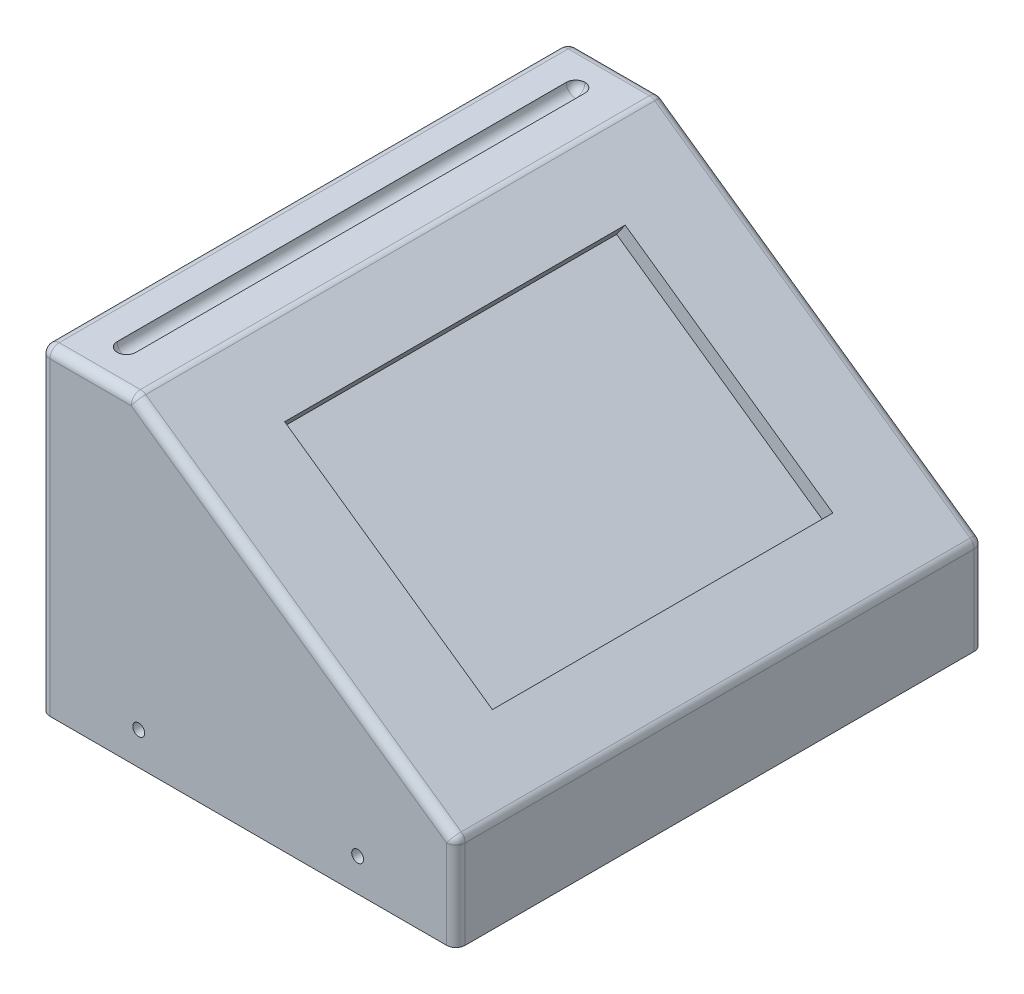
ISO-10303-21;
HEADER;
FILE_DESCRIPTION(('STEP AP214'),'2;1');
FILE_NAME('part.step','',(''),(''),'','','');
FILE_SCHEMA(('AUTOMOTIVE_DESIGN { 1 0 10303 214 1 1 1 1 }'));
ENDSEC;
DATA;
#1=APPLICATION_CONTEXT('core data for automotive mechanical design processes');
#2=APPLICATION_PROTOCOL_DEFINITION('international standard','automotive_design',2000,#1);
#3=PRODUCT_CONTEXT('',#1,'mechanical');
#4=PRODUCT('Part','Part','',(#3));
#5=PRODUCT_RELATED_PRODUCT_CATEGORY('part','',(#4));
#6=PRODUCT_DEFINITION_FORMATION('','',#4);
#7=PRODUCT_DEFINITION_CONTEXT('part definition',#1,'design');
#8=PRODUCT_DEFINITION('design','',#6,#7);
#9=PRODUCT_DEFINITION_SHAPE('','',#8);
#10=(LENGTH_UNIT() NAMED_UNIT(*) SI_UNIT(.MILLI.,.METRE.));
#11=(NAMED_UNIT(*) PLANE_ANGLE_UNIT() SI_UNIT($,.RADIAN.));
#12=(NAMED_UNIT(*) SI_UNIT($,.STERADIAN.) SOLID_ANGLE_UNIT());
#13=UNCERTAINTY_MEASURE_WITH_UNIT(LENGTH_MEASURE(1.E-05),#10,'distance_accuracy_value','');
#14=(GEOMETRIC_REPRESENTATION_CONTEXT(3) GLOBAL_UNCERTAINTY_ASSIGNED_CONTEXT((#13)) GLOBAL_UNIT_ASSIGNED_CONTEXT((#10,
#11,#12)) REPRESENTATION_CONTEXT('',''));
#15=CARTESIAN_POINT('',(0.,0.,0.));
#16=DIRECTION('',(0.,0.,1.));
#17=DIRECTION('',(1.,0.,0.));
#18=AXIS2_PLACEMENT_3D('',#15,#16,#17);
#19=CARTESIAN_POINT('',(0.,120.451051633721,282.));
#20=DIRECTION('',(0.,-1.,0.));
#21=DIRECTION('',(1.,0.,0.));
#22=AXIS2_PLACEMENT_3D('',#19,#20,#21);
#23=PLANE('',#22);
#24=DIRECTION('',(0.,0.,-1.));
#25=VECTOR('',#24,1.);
#26=CARTESIAN_POINT('',(-173.598423245083,120.451051633721,282.));
#27=LINE('',#26,#25);
#28=CARTESIAN_POINT('',(-173.598423245083,120.451051633721,277.));
#29=VERTEX_POINT('',#28);
#30=CARTESIAN_POINT('',(-173.598423245083,120.451051633721,5.));
#31=VERTEX_POINT('',#30);
#32=EDGE_CURVE('E287',#29,#31,#27,.T.);
#33=ORIENTED_EDGE('',*,*,#32,.T.);
#34=DIRECTION('',(-1.,0.,0.));
#35=VECTOR('',#34,1.);
#36=CARTESIAN_POINT('',(0.,120.451051633721,5.));
#37=LINE('',#36,#35);
#38=CARTESIAN_POINT('',(-217.021929300688,120.451051633721,5.));
#39=VERTEX_POINT('',#38);
#40=EDGE_CURVE('E290',#31,#39,#37,.T.);
#41=ORIENTED_EDGE('',*,*,#40,.T.);
#42=DIRECTION('',(0.,0.,-1.));
#43=VECTOR('',#42,1.);
#44=CARTESIAN_POINT('',(-217.021929300688,120.451051633721,282.));
#45=LINE('',#44,#43);
#46=CARTESIAN_POINT('',(-217.021929300688,120.451051633721,277.));
#47=VERTEX_POINT('',#46);
#48=EDGE_CURVE('E285',#39,#47,#45,.F.);
#49=ORIENTED_EDGE('',*,*,#48,.T.);
#50=DIRECTION('',(-1.,0.,0.));
#51=VECTOR('',#50,1.);
#52=CARTESIAN_POINT('',(-172.021929300688,120.451051633721,277.));
#53=LINE('',#52,#51);
#54=EDGE_CURVE('E283',#47,#29,#53,.F.);
#55=ORIENTED_EDGE('',*,*,#54,.T.);
#56=EDGE_LOOP('',(#33,#41,#49,#55));
#57=FACE_BOUND('',#56,.T.);
#58=CARTESIAN_POINT('',(-197.021929300688,120.451051633721,261.));
#59=DIRECTION('',(0.,-1.,0.));
#60=DIRECTION('',(1.,0.,0.));
#61=AXIS2_PLACEMENT_3D('',#58,#59,#60);
#62=CIRCLE('',#61,5.);
#63=CARTESIAN_POINT('',(-192.021929300688,120.451051633721,261.));
#64=VERTEX_POINT('',#63);
#65=CARTESIAN_POINT('',(-197.021929300688,120.451051633721,266.));
#66=VERTEX_POINT('',#65);
#67=EDGE_CURVE('E237',#64,#66,#62,.T.);
#68=ORIENTED_EDGE('',*,*,#67,.T.);
#69=CARTESIAN_POINT('',(-197.021929300688,120.451051633721,261.));
#70=DIRECTION('',(0.,-1.,0.));
#71=DIRECTION('',(1.,0.,0.));
#72=AXIS2_PLACEMENT_3D('',#69,#70,#71);
#73=CIRCLE('',#72,5.);
#74=CARTESIAN_POINT('',(-202.021929300688,120.451051633721,261.));
#75=VERTEX_POINT('',#74);
#76=EDGE_CURVE('E240',#66,#75,#73,.T.);
#77=ORIENTED_EDGE('',*,*,#76,.T.);
#78=DIRECTION('',(0.,0.,-1.));
#79=VECTOR('',#78,1.);
#80=CARTESIAN_POINT('',(-202.021929300688,120.451051633721,0.));
#81=LINE('',#80,#79);
#82=CARTESIAN_POINT('',(-202.021929300688,120.451051633721,21.));
#83=VERTEX_POINT('',#82);
#84=EDGE_CURVE('E267',#75,#83,#81,.T.);
#85=ORIENTED_EDGE('',*,*,#84,.T.);
#86=CARTESIAN_POINT('',(-197.021929300688,120.451051633721,21.));
#87=DIRECTION('',(0.,-1.,0.));
#88=DIRECTION('',(1.,0.,0.));
#89=AXIS2_PLACEMENT_3D('',#86,#87,#88);
#90=CIRCLE('',#89,5.);
#91=CARTESIAN_POINT('',(-197.021929300688,120.451051633721,16.));
#92=VERTEX_POINT('',#91);
#93=EDGE_CURVE('E244',#83,#92,#90,.T.);
#94=ORIENTED_EDGE('',*,*,#93,.T.);
#95=CARTESIAN_POINT('',(-197.021929300688,120.451051633721,21.));
#96=DIRECTION('',(0.,-1.,0.));
#97=DIRECTION('',(1.,0.,0.));
#98=AXIS2_PLACEMENT_3D('',#95,#96,#97);
#99=CIRCLE('',#98,5.);
#100=CARTESIAN_POINT('',(-192.021929300688,120.451051633721,21.));
#101=VERTEX_POINT('',#100);
#102=EDGE_CURVE('E242',#92,#101,#99,.T.);
#103=ORIENTED_EDGE('',*,*,#102,.T.);
#104=DIRECTION('',(0.,0.,-1.));
#105=VECTOR('',#104,1.);
#106=CARTESIAN_POINT('',(-192.021929300688,120.451051633721,0.));
#107=LINE('',#106,#105);
#108=EDGE_CURVE('E210',#64,#101,#107,.T.);
#109=ORIENTED_EDGE('',*,*,#108,.F.);
#110=EDGE_LOOP('',(#68,#77,#85,#94,#103,#109));
#111=FACE_BOUND('',#110,.T.);
#112=ADVANCED_FACE('F39',(#57,#111),#23,.F.);
#113=CARTESIAN_POINT('',(-222.021929300688,0.,282.));
#114=DIRECTION('',(1.,0.,0.));
#115=DIRECTION('',(0.,0.,-1.));
#116=AXIS2_PLACEMENT_3D('',#113,#114,#115);
#117=PLANE('',#116);
#118=DIRECTION('',(0.,0.,-1.));
#119=VECTOR('',#118,1.);
#120=CARTESIAN_POINT('',(-222.021929300688,115.451051633721,282.));
#121=LINE('',#120,#119);
#122=CARTESIAN_POINT('',(-222.021929300688,115.451051633721,277.));
#123=VERTEX_POINT('',#122);
#124=CARTESIAN_POINT('',(-222.021929300688,115.451051633721,5.));
#125=VERTEX_POINT('',#124);
#126=EDGE_CURVE('E294',#123,#125,#121,.T.);
#127=ORIENTED_EDGE('',*,*,#126,.T.);
#128=DIRECTION('',(0.,-1.,0.));
#129=VECTOR('',#128,1.);
#130=CARTESIAN_POINT('',(-222.021929300688,0.,5.));
#131=LINE('',#130,#129);
#132=CARTESIAN_POINT('',(-222.021929300688,-50.,5.));
#133=VERTEX_POINT('',#132);
#134=EDGE_CURVE('E296',#125,#133,#131,.T.);
#135=ORIENTED_EDGE('',*,*,#134,.T.);
#136=DIRECTION('',(0.,0.,-1.));
#137=VECTOR('',#136,1.);
#138=CARTESIAN_POINT('',(-222.021929300688,-50.,282.));
#139=LINE('',#138,#137);
#140=CARTESIAN_POINT('',(-222.021929300688,-50.,277.));
#141=VERTEX_POINT('',#140);
#142=EDGE_CURVE('E234',#141,#133,#139,.T.);
#143=ORIENTED_EDGE('',*,*,#142,.F.);
#144=DIRECTION('',(0.,-1.,0.));
#145=VECTOR('',#144,1.);
#146=CARTESIAN_POINT('',(-222.021929300688,120.451051633721,277.));
#147=LINE('',#146,#145);
#148=EDGE_CURVE('E292',#141,#123,#147,.F.);
#149=ORIENTED_EDGE('',*,*,#148,.T.);
#150=EDGE_LOOP('',(#127,#135,#143,#149));
#151=FACE_BOUND('',#150,.T.);
#152=ADVANCED_FACE('F424',(#151),#117,.F.);
#153=CARTESIAN_POINT('',(0.,-50.,282.));
#154=DIRECTION('',(0.,-1.,0.));
#155=DIRECTION('',(1.,0.,0.));
#156=AXIS2_PLACEMENT_3D('',#153,#154,#155);
#157=PLANE('',#156);
#158=ORIENTED_EDGE('',*,*,#142,.T.);
#159=CARTESIAN_POINT('',(-217.021929300688,-50.,5.));
#160=DIRECTION('',(0.,-1.,0.));
#161=DIRECTION('',(1.,0.,0.));
#162=AXIS2_PLACEMENT_3D('',#159,#160,#161);
#163=CIRCLE('',#162,5.);
#164=CARTESIAN_POINT('',(-217.021929300688,-50.,0.));
#165=VERTEX_POINT('',#164);
#166=EDGE_CURVE('E304',#133,#165,#163,.T.);
#167=ORIENTED_EDGE('',*,*,#166,.T.);
#168=DIRECTION('',(-1.,0.,0.));
#169=VECTOR('',#168,1.);
#170=CARTESIAN_POINT('',(0.,-50.,0.));
#171=LINE('',#170,#169);
#172=CARTESIAN_POINT('',(-5.,-50.,0.));
#173=VERTEX_POINT('',#172);
#174=EDGE_CURVE('E222',#173,#165,#171,.T.);
#175=ORIENTED_EDGE('',*,*,#174,.F.);
#176=CARTESIAN_POINT('',(-5.,-50.,5.));
#177=DIRECTION('',(0.,-1.,0.));
#178=DIRECTION('',(1.,0.,0.));
#179=AXIS2_PLACEMENT_3D('',#176,#177,#178);
#180=CIRCLE('',#179,5.);
#181=CARTESIAN_POINT('',(0.,-50.,5.));
#182=VERTEX_POINT('',#181);
#183=EDGE_CURVE('E302',#173,#182,#180,.T.);
#184=ORIENTED_EDGE('',*,*,#183,.T.);
#185=DIRECTION('',(0.,0.,-1.));
#186=VECTOR('',#185,1.);
#187=CARTESIAN_POINT('',(0.,-50.,282.));
#188=LINE('',#187,#186);
#189=CARTESIAN_POINT('',(0.,-50.,277.));
#190=VERTEX_POINT('',#189);
#191=EDGE_CURVE('E229',#190,#182,#188,.T.);
#192=ORIENTED_EDGE('',*,*,#191,.F.);
#193=CARTESIAN_POINT('',(-5.,-50.,277.));
#194=DIRECTION('',(0.,-1.,0.));
#195=DIRECTION('',(1.,0.,0.));
#196=AXIS2_PLACEMENT_3D('',#193,#194,#195);
#197=CIRCLE('',#196,5.);
#198=CARTESIAN_POINT('',(-5.,-50.,282.));
#199=VERTEX_POINT('',#198);
#200=EDGE_CURVE('E300',#190,#199,#197,.T.);
#201=ORIENTED_EDGE('',*,*,#200,.T.);
#202=DIRECTION('',(-1.,0.,0.));
#203=VECTOR('',#202,1.);
#204=CARTESIAN_POINT('',(0.,-50.,282.));
#205=LINE('',#204,#203);
#206=CARTESIAN_POINT('',(-217.021929300688,-50.,282.));
#207=VERTEX_POINT('',#206);
#208=EDGE_CURVE('E226',#199,#207,#205,.T.);
#209=ORIENTED_EDGE('',*,*,#208,.T.);
#210=CARTESIAN_POINT('',(-217.021929300688,-50.,277.));
#211=DIRECTION('',(0.,-1.,0.));
#212=DIRECTION('',(1.,0.,0.));
#213=AXIS2_PLACEMENT_3D('',#210,#211,#212);
#214=CIRCLE('',#213,5.);
#215=EDGE_CURVE('E298',#207,#141,#214,.T.);
#216=ORIENTED_EDGE('',*,*,#215,.T.);
#217=EDGE_LOOP('',(#158,#167,#175,#184,#192,#201,#209,#216));
#218=FACE_BOUND('',#217,.T.);
#219=ADVANCED_FACE('F430',(#218),#157,.T.);
#220=CARTESIAN_POINT('',(0.,0.,282.));
#221=DIRECTION('',(1.,0.,0.));
#222=DIRECTION('',(0.,0.,-1.));
#223=AXIS2_PLACEMENT_3D('',#220,#221,#222);
#224=PLANE('',#223);
#225=ORIENTED_EDGE('',*,*,#191,.T.);
#226=DIRECTION('',(0.,-1.,0.));
#227=VECTOR('',#226,1.);
#228=CARTESIAN_POINT('',(0.,0.,5.));
#229=LINE('',#228,#227);
#230=CARTESIAN_POINT('',(0.,-2.60283525275872,5.));
#231=VERTEX_POINT('',#230);
#232=EDGE_CURVE('E281',#182,#231,#229,.F.);
#233=ORIENTED_EDGE('',*,*,#232,.T.);
#234=DIRECTION('',(0.,0.,-1.));
#235=VECTOR('',#234,1.);
#236=CARTESIAN_POINT('',(0.,-2.60283525275872,282.));
#237=LINE('',#236,#235);
#238=CARTESIAN_POINT('',(0.,-2.60283525275872,277.));
#239=VERTEX_POINT('',#238);
#240=EDGE_CURVE('E278',#231,#239,#237,.F.);
#241=ORIENTED_EDGE('',*,*,#240,.T.);
#242=DIRECTION('',(0.,-1.,0.));
#243=VECTOR('',#242,1.);
#244=CARTESIAN_POINT('',(0.,0.,277.));
#245=LINE('',#244,#243);
#246=EDGE_CURVE('E276',#239,#190,#245,.T.);
#247=ORIENTED_EDGE('',*,*,#246,.T.);
#248=EDGE_LOOP('',(#225,#233,#241,#247));
#249=FACE_BOUND('',#248,.T.);
#250=ADVANCED_FACE('F791',(#249),#224,.T.);
#251=CARTESIAN_POINT('',(0.,0.,282.));
#252=DIRECTION('',(-0.57357643635105,-0.819152044288989,0.));
#253=DIRECTION('',(0.819152044288989,-0.57357643635105,0.));
#254=AXIS2_PLACEMENT_3D('',#251,#252,#253);
#255=PLANE('',#254);
#256=DIRECTION('',(0.,0.,-1.));
#257=VECTOR('',#256,1.);
#258=CARTESIAN_POINT('',(-2.13211781824475,1.49292496868623,0.));
#259=LINE('',#258,#257);
#260=CARTESIAN_POINT('',(-2.13211781824475,1.49292496868623,277.));
#261=VERTEX_POINT('',#260);
#262=CARTESIAN_POINT('',(-2.13211781824475,1.49292496868623,5.));
#263=VERTEX_POINT('',#262);
#264=EDGE_CURVE('E271',#261,#263,#259,.T.);
#265=ORIENTED_EDGE('',*,*,#264,.T.);
#266=DIRECTION('',(-0.819152044288989,0.57357643635105,0.));
#267=VECTOR('',#266,1.);
#268=CARTESIAN_POINT('',(0.,0.,5.));
#269=LINE('',#268,#267);
#270=CARTESIAN_POINT('',(-170.730541063327,119.546811855165,5.));
#271=VERTEX_POINT('',#270);
#272=EDGE_CURVE('E274',#263,#271,#269,.T.);
#273=ORIENTED_EDGE('',*,*,#272,.T.);
#274=DIRECTION('',(0.,0.,-1.));
#275=VECTOR('',#274,1.);
#276=CARTESIAN_POINT('',(-170.730541063327,119.546811855165,282.));
#277=LINE('',#276,#275);
#278=CARTESIAN_POINT('',(-170.730541063327,119.546811855165,277.));
#279=VERTEX_POINT('',#278);
#280=EDGE_CURVE('E269',#271,#279,#277,.F.);
#281=ORIENTED_EDGE('',*,*,#280,.T.);
#282=DIRECTION('',(-0.819152044288989,0.57357643635105,0.));
#283=VECTOR('',#282,1.);
#284=CARTESIAN_POINT('',(0.,0.,277.));
#285=LINE('',#284,#283);
#286=EDGE_CURVE('E246',#279,#261,#285,.F.);
#287=ORIENTED_EDGE('',*,*,#286,.T.);
#288=EDGE_LOOP('',(#265,#273,#281,#287));
#289=FACE_BOUND('',#288,.T.);
#290=DIRECTION('',(0.819152044288989,-0.57357643635105,0.));
#291=VECTOR('',#290,1.);
#292=CARTESIAN_POINT('',(0.,0.,232.));
#293=LINE('',#292,#291);
#294=CARTESIAN_POINT('',(-141.521587226098,99.0944821951176,232.));
#295=VERTEX_POINT('',#294);
#296=CARTESIAN_POINT('',(-30.5003420745901,21.356569438603,232.));
#297=VERTEX_POINT('',#296);
#298=EDGE_CURVE('E216',#295,#297,#293,.T.);
#299=ORIENTED_EDGE('',*,*,#298,.F.);
#300=DIRECTION('',(0.,0.,1.));
#301=VECTOR('',#300,1.);
#302=CARTESIAN_POINT('',(-141.521587226098,99.0944821951176,0.));
#303=LINE('',#302,#301);
#304=CARTESIAN_POINT('',(-141.521587226098,99.0944821951176,50.));
#305=VERTEX_POINT('',#304);
#306=EDGE_CURVE('E187',#305,#295,#303,.T.);
#307=ORIENTED_EDGE('',*,*,#306,.F.);
#308=DIRECTION('',(0.819152044288989,-0.57357643635105,0.));
#309=VECTOR('',#308,1.);
#310=CARTESIAN_POINT('',(0.,0.,50.));
#311=LINE('',#310,#309);
#312=CARTESIAN_POINT('',(-30.50034207459,21.3565694386029,50.));
#313=VERTEX_POINT('',#312);
#314=EDGE_CURVE('E204',#305,#313,#311,.T.);
#315=ORIENTED_EDGE('',*,*,#314,.T.);
#316=DIRECTION('',(0.,0.,1.));
#317=VECTOR('',#316,1.);
#318=CARTESIAN_POINT('',(-30.50034207459,21.3565694386029,0.));
#319=LINE('',#318,#317);
#320=EDGE_CURVE('E207',#313,#297,#319,.T.);
#321=ORIENTED_EDGE('',*,*,#320,.T.);
#322=EDGE_LOOP('',(#299,#307,#315,#321));
#323=FACE_BOUND('',#322,.T.);
#324=ADVANCED_FACE('F784',(#289,#323),#255,.F.);
#325=CARTESIAN_POINT('',(0.,0.,282.));
#326=DIRECTION('',(0.,0.,1.));
#327=DIRECTION('',(1.,0.,0.));
#328=AXIS2_PLACEMENT_3D('',#325,#326,#327);
#329=PLANE('',#328);
#330=ORIENTED_EDGE('',*,*,#208,.F.);
#331=DIRECTION('',(0.,-1.,0.));
#332=VECTOR('',#331,1.);
#333=CARTESIAN_POINT('',(-5.,0.,282.));
#334=LINE('',#333,#332);
#335=CARTESIAN_POINT('',(-5.,-2.60283525275872,282.));
#336=VERTEX_POINT('',#335);
#337=EDGE_CURVE('E11',#199,#336,#334,.F.);
#338=ORIENTED_EDGE('',*,*,#337,.T.);
#339=DIRECTION('',(-0.819152044288989,0.57357643635105,0.));
#340=VECTOR('',#339,1.);
#341=CARTESIAN_POINT('',(-174.889811482443,116.355291412276,282.));
#342=LINE('',#341,#340);
#343=CARTESIAN_POINT('',(-173.598423245083,115.451051633721,282.));
#344=VERTEX_POINT('',#343);
#345=EDGE_CURVE('E60',#336,#344,#342,.T.);
#346=ORIENTED_EDGE('',*,*,#345,.T.);
#347=DIRECTION('',(-1.,0.,0.));
#348=VECTOR('',#347,1.);
#349=CARTESIAN_POINT('',(-222.021929300688,115.451051633721,282.));
#350=LINE('',#349,#348);
#351=CARTESIAN_POINT('',(-217.021929300688,115.451051633721,282.));
#352=VERTEX_POINT('',#351);
#353=EDGE_CURVE('E56',#344,#352,#350,.T.);
#354=ORIENTED_EDGE('',*,*,#353,.T.);
#355=DIRECTION('',(0.,-1.,0.));
#356=VECTOR('',#355,1.);
#357=CARTESIAN_POINT('',(-217.021929300688,-50.,282.));
#358=LINE('',#357,#356);
#359=EDGE_CURVE('E48',#352,#207,#358,.T.);
#360=ORIENTED_EDGE('',*,*,#359,.T.);
#361=EDGE_LOOP('',(#330,#338,#346,#354,#360));
#362=FACE_BOUND('',#361,.T.);
#363=CARTESIAN_POINT('',(-52.5,-32.5,282.));
#364=DIRECTION('',(0.,0.,1.));
#365=DIRECTION('',(1.,0.,0.));
#366=AXIS2_PLACEMENT_3D('',#363,#364,#365);
#367=CIRCLE('',#366,3.175);
#368=CARTESIAN_POINT('',(-49.325,-32.5,282.));
#369=VERTEX_POINT('',#368);
#370=EDGE_CURVE('E381',#369,#369,#367,.T.);
#371=ORIENTED_EDGE('',*,*,#370,.F.);
#372=EDGE_LOOP('',(#371));
#373=FACE_BOUND('',#372,.T.);
#374=CARTESIAN_POINT('',(-169.521929300688,-32.5,282.));
#375=DIRECTION('',(0.,0.,1.));
#376=DIRECTION('',(1.,0.,0.));
#377=AXIS2_PLACEMENT_3D('',#374,#375,#376);
#378=CIRCLE('',#377,3.175);
#379=CARTESIAN_POINT('',(-166.346929300688,-32.5,282.));
#380=VERTEX_POINT('',#379);
#381=EDGE_CURVE('E384',#380,#380,#378,.T.);
#382=ORIENTED_EDGE('',*,*,#381,.F.);
#383=EDGE_LOOP('',(#382));
#384=FACE_BOUND('',#383,.T.);
#385=ADVANCED_FACE('F777',(#362,#373,#384),#329,.T.);
#386=CARTESIAN_POINT('',(0.,0.,0.));
#387=DIRECTION('',(0.,0.,1.));
#388=DIRECTION('',(1.,0.,0.));
#389=AXIS2_PLACEMENT_3D('',#386,#387,#388);
#390=PLANE('',#389);
#391=CARTESIAN_POINT('',(-169.521929300688,-32.5,0.));
#392=DIRECTION('',(0.,0.,-1.));
#393=DIRECTION('',(-1.,0.,0.));
#394=AXIS2_PLACEMENT_3D('',#391,#392,#393);
#395=CIRCLE('',#394,3.175);
#396=CARTESIAN_POINT('',(-172.696929300688,-32.5,0.));
#397=VERTEX_POINT('',#396);
#398=EDGE_CURVE('E375',#397,#397,#395,.T.);
#399=ORIENTED_EDGE('',*,*,#398,.F.);
#400=EDGE_LOOP('',(#399));
#401=FACE_BOUND('',#400,.T.);
#402=CARTESIAN_POINT('',(-52.5,-32.5,0.));
#403=DIRECTION('',(0.,0.,-1.));
#404=DIRECTION('',(-1.,0.,0.));
#405=AXIS2_PLACEMENT_3D('',#402,#403,#404);
#406=CIRCLE('',#405,3.175);
#407=CARTESIAN_POINT('',(-55.675,-32.5,0.));
#408=VERTEX_POINT('',#407);
#409=EDGE_CURVE('E367',#408,#408,#406,.T.);
#410=ORIENTED_EDGE('',*,*,#409,.F.);
#411=EDGE_LOOP('',(#410));
#412=FACE_BOUND('',#411,.T.);
#413=ORIENTED_EDGE('',*,*,#174,.T.);
#414=DIRECTION('',(0.,-1.,0.));
#415=VECTOR('',#414,1.);
#416=CARTESIAN_POINT('',(-217.021929300688,0.,0.));
#417=LINE('',#416,#415);
#418=CARTESIAN_POINT('',(-217.021929300688,115.451051633721,0.));
#419=VERTEX_POINT('',#418);
#420=EDGE_CURVE('E312',#165,#419,#417,.F.);
#421=ORIENTED_EDGE('',*,*,#420,.T.);
#422=DIRECTION('',(-1.,0.,0.));
#423=VECTOR('',#422,1.);
#424=CARTESIAN_POINT('',(0.,115.451051633721,0.));
#425=LINE('',#424,#423);
#426=CARTESIAN_POINT('',(-173.598423245083,115.451051633721,0.));
#427=VERTEX_POINT('',#426);
#428=EDGE_CURVE('E310',#419,#427,#425,.F.);
#429=ORIENTED_EDGE('',*,*,#428,.T.);
#430=DIRECTION('',(-0.819152044288989,0.57357643635105,0.));
#431=VECTOR('',#430,1.);
#432=CARTESIAN_POINT('',(-2.86788218175525,-4.09576022144495,0.));
#433=LINE('',#432,#431);
#434=CARTESIAN_POINT('',(-5.,-2.60283525275872,0.));
#435=VERTEX_POINT('',#434);
#436=EDGE_CURVE('E308',#427,#435,#433,.F.);
#437=ORIENTED_EDGE('',*,*,#436,.T.);
#438=DIRECTION('',(0.,-1.,0.));
#439=VECTOR('',#438,1.);
#440=CARTESIAN_POINT('',(-5.,-50.,0.));
#441=LINE('',#440,#439);
#442=EDGE_CURVE('E306',#435,#173,#441,.T.);
#443=ORIENTED_EDGE('',*,*,#442,.T.);
#444=EDGE_LOOP('',(#413,#421,#429,#437,#443));
#445=FACE_BOUND('',#444,.T.);
#446=ADVANCED_FACE('F768',(#401,#412,#445),#390,.F.);
#447=CARTESIAN_POINT('',(-146.110198716906,92.5412658408057,0.));
#448=DIRECTION('',(-0.819152044288989,0.57357643635105,0.));
#449=DIRECTION('',(-0.57357643635105,-0.819152044288989,0.));
#450=AXIS2_PLACEMENT_3D('',#447,#448,#449);
#451=PLANE('',#450);
#452=ORIENTED_EDGE('',*,*,#306,.T.);
#453=DIRECTION('',(0.57357643635105,0.819152044288989,0.));
#454=VECTOR('',#453,1.);
#455=CARTESIAN_POINT('',(-146.110198716906,92.5412658408057,232.));
#456=LINE('',#455,#454);
#457=CARTESIAN_POINT('',(-146.110198716906,92.5412658408057,232.));
#458=VERTEX_POINT('',#457);
#459=EDGE_CURVE('E181',#458,#295,#456,.T.);
#460=ORIENTED_EDGE('',*,*,#459,.F.);
#461=DIRECTION('',(0.,0.,1.));
#462=VECTOR('',#461,1.);
#463=CARTESIAN_POINT('',(-146.110198716906,92.5412658408057,0.));
#464=LINE('',#463,#462);
#465=CARTESIAN_POINT('',(-146.110198716906,92.5412658408057,50.));
#466=VERTEX_POINT('',#465);
#467=EDGE_CURVE('E185',#466,#458,#464,.T.);
#468=ORIENTED_EDGE('',*,*,#467,.F.);
#469=DIRECTION('',(0.57357643635105,0.819152044288989,0.));
#470=VECTOR('',#469,1.);
#471=CARTESIAN_POINT('',(-146.110198716906,92.5412658408057,50.));
#472=LINE('',#471,#470);
#473=EDGE_CURVE('E220',#466,#305,#472,.T.);
#474=ORIENTED_EDGE('',*,*,#473,.T.);
#475=EDGE_LOOP('',(#452,#460,#468,#474));
#476=FACE_BOUND('',#475,.T.);
#477=ADVANCED_FACE('F183',(#476),#451,.F.);
#478=CARTESIAN_POINT('',(-4.5886114908084,-6.55321635431191,50.));
#479=DIRECTION('',(0.,0.,1.));
#480=DIRECTION('',(1.,0.,0.));
#481=AXIS2_PLACEMENT_3D('',#478,#479,#480);
#482=PLANE('',#481);
#483=ORIENTED_EDGE('',*,*,#314,.F.);
#484=ORIENTED_EDGE('',*,*,#473,.F.);
#485=DIRECTION('',(0.819152044288989,-0.57357643635105,0.));
#486=VECTOR('',#485,1.);
#487=CARTESIAN_POINT('',(-4.5886114908084,-6.55321635431191,50.));
#488=LINE('',#487,#486);
#489=CARTESIAN_POINT('',(-35.0889535653984,14.803353084291,50.));
#490=VERTEX_POINT('',#489);
#491=EDGE_CURVE('E192',#466,#490,#488,.T.);
#492=ORIENTED_EDGE('',*,*,#491,.T.);
#493=DIRECTION('',(0.57357643635105,0.819152044288989,0.));
#494=VECTOR('',#493,1.);
#495=CARTESIAN_POINT('',(-35.0889535653984,14.803353084291,50.));
#496=LINE('',#495,#494);
#497=EDGE_CURVE('E223',#490,#313,#496,.T.);
#498=ORIENTED_EDGE('',*,*,#497,.T.);
#499=EDGE_LOOP('',(#483,#484,#492,#498));
#500=FACE_BOUND('',#499,.T.);
#501=ADVANCED_FACE('F750',(#500),#482,.T.);
#502=CARTESIAN_POINT('',(-35.0889535653984,14.803353084291,0.));
#503=DIRECTION('',(-0.819152044288989,0.57357643635105,0.));
#504=DIRECTION('',(-0.57357643635105,-0.819152044288989,0.));
#505=AXIS2_PLACEMENT_3D('',#502,#503,#504);
#506=PLANE('',#505);
#507=ORIENTED_EDGE('',*,*,#320,.F.);
#508=ORIENTED_EDGE('',*,*,#497,.F.);
#509=DIRECTION('',(0.,0.,1.));
#510=VECTOR('',#509,1.);
#511=CARTESIAN_POINT('',(-35.0889535653984,14.803353084291,0.));
#512=LINE('',#511,#510);
#513=CARTESIAN_POINT('',(-35.0889535653985,14.8033530842911,232.));
#514=VERTEX_POINT('',#513);
#515=EDGE_CURVE('E200',#490,#514,#512,.T.);
#516=ORIENTED_EDGE('',*,*,#515,.T.);
#517=DIRECTION('',(0.57357643635105,0.819152044288989,0.));
#518=VECTOR('',#517,1.);
#519=CARTESIAN_POINT('',(-35.0889535653985,14.8033530842911,232.));
#520=LINE('',#519,#518);
#521=EDGE_CURVE('E191',#514,#297,#520,.T.);
#522=ORIENTED_EDGE('',*,*,#521,.T.);
#523=EDGE_LOOP('',(#507,#508,#516,#522));
#524=FACE_BOUND('',#523,.T.);
#525=ADVANCED_FACE('F741',(#524),#506,.T.);
#526=CARTESIAN_POINT('',(-4.5886114908084,-6.55321635431191,232.));
#527=DIRECTION('',(0.,0.,1.));
#528=DIRECTION('',(1.,0.,0.));
#529=AXIS2_PLACEMENT_3D('',#526,#527,#528);
#530=PLANE('',#529);
#531=ORIENTED_EDGE('',*,*,#298,.T.);
#532=ORIENTED_EDGE('',*,*,#521,.F.);
#533=DIRECTION('',(0.819152044288989,-0.57357643635105,0.));
#534=VECTOR('',#533,1.);
#535=CARTESIAN_POINT('',(-4.5886114908084,-6.55321635431191,232.));
#536=LINE('',#535,#534);
#537=EDGE_CURVE('E196',#458,#514,#536,.T.);
#538=ORIENTED_EDGE('',*,*,#537,.F.);
#539=ORIENTED_EDGE('',*,*,#459,.T.);
#540=EDGE_LOOP('',(#531,#532,#538,#539));
#541=FACE_BOUND('',#540,.T.);
#542=ADVANCED_FACE('F197',(#541),#530,.F.);
#543=CARTESIAN_POINT('',(-4.5886114908084,-6.55321635431191,0.));
#544=DIRECTION('',(0.57357643635105,0.819152044288989,0.));
#545=DIRECTION('',(-0.819152044288989,0.57357643635105,0.));
#546=AXIS2_PLACEMENT_3D('',#543,#544,#545);
#547=PLANE('',#546);
#548=ORIENTED_EDGE('',*,*,#467,.T.);
#549=ORIENTED_EDGE('',*,*,#537,.T.);
#550=ORIENTED_EDGE('',*,*,#515,.F.);
#551=ORIENTED_EDGE('',*,*,#491,.F.);
#552=EDGE_LOOP('',(#548,#549,#550,#551));
#553=FACE_BOUND('',#552,.T.);
#554=ADVANCED_FACE('F203',(#553),#547,.T.);
#555=CARTESIAN_POINT('',(-197.021929300688,120.451051633721,21.));
#556=DIRECTION('',(0.,0.,-1.));
#557=DIRECTION('',(0.,1.,0.));
#558=AXIS2_PLACEMENT_3D('',#555,#556,#557);
#559=SPHERICAL_SURFACE('',#558,5.);
#560=CARTESIAN_POINT('',(-197.021929300688,120.451051633721,21.));
#561=DIRECTION('',(1.,0.,0.));
#562=DIRECTION('',(0.,0.,-1.));
#563=AXIS2_PLACEMENT_3D('',#560,#561,#562);
#564=CIRCLE('',#563,5.);
#565=CARTESIAN_POINT('',(-197.021929300688,115.451051633721,21.));
#566=VERTEX_POINT('',#565);
#567=EDGE_CURVE('E264',#92,#566,#564,.F.);
#568=ORIENTED_EDGE('',*,*,#567,.F.);
#569=ORIENTED_EDGE('',*,*,#93,.F.);
#570=CARTESIAN_POINT('',(-197.021929300688,120.451051633721,21.));
#571=DIRECTION('',(0.,0.,1.));
#572=DIRECTION('',(1.,0.,0.));
#573=AXIS2_PLACEMENT_3D('',#570,#571,#572);
#574=CIRCLE('',#573,5.);
#575=EDGE_CURVE('E259',#566,#83,#574,.F.);
#576=ORIENTED_EDGE('',*,*,#575,.F.);
#577=EDGE_LOOP('',(#568,#569,#576));
#578=FACE_BOUND('',#577,.T.);
#579=ADVANCED_FACE('F415',(#578),#559,.F.);
#580=CARTESIAN_POINT('',(-197.021929300688,120.451051633721,261.));
#581=DIRECTION('',(-1.,0.,0.));
#582=DIRECTION('',(0.,0.,1.));
#583=AXIS2_PLACEMENT_3D('',#580,#581,#582);
#584=SPHERICAL_SURFACE('',#583,5.);
#585=CARTESIAN_POINT('',(-197.021929300688,120.451051633721,261.));
#586=DIRECTION('',(0.,0.,-1.));
#587=DIRECTION('',(-1.,0.,0.));
#588=AXIS2_PLACEMENT_3D('',#585,#586,#587);
#589=CIRCLE('',#588,5.);
#590=CARTESIAN_POINT('',(-197.021929300688,115.451051633721,261.));
#591=VERTEX_POINT('',#590);
#592=EDGE_CURVE('E262',#75,#591,#589,.F.);
#593=ORIENTED_EDGE('',*,*,#592,.F.);
#594=ORIENTED_EDGE('',*,*,#76,.F.);
#595=CARTESIAN_POINT('',(-197.021929300688,120.451051633721,261.));
#596=DIRECTION('',(1.,0.,0.));
#597=DIRECTION('',(0.,0.,-1.));
#598=AXIS2_PLACEMENT_3D('',#595,#596,#597);
#599=CIRCLE('',#598,5.);
#600=EDGE_CURVE('E257',#591,#66,#599,.F.);
#601=ORIENTED_EDGE('',*,*,#600,.F.);
#602=EDGE_LOOP('',(#593,#594,#601));
#603=FACE_BOUND('',#602,.T.);
#604=ADVANCED_FACE('F413',(#603),#584,.F.);
#605=CARTESIAN_POINT('',(-197.021929300688,120.451051633721,0.));
#606=DIRECTION('',(0.,0.,1.));
#607=DIRECTION('',(1.,0.,0.));
#608=AXIS2_PLACEMENT_3D('',#605,#606,#607);
#609=CYLINDRICAL_SURFACE('',#608,5.);
#610=ORIENTED_EDGE('',*,*,#84,.F.);
#611=ORIENTED_EDGE('',*,*,#592,.T.);
#612=DIRECTION('',(0.,0.,-1.));
#613=VECTOR('',#612,1.);
#614=CARTESIAN_POINT('',(-197.021929300688,115.451051633721,266.));
#615=LINE('',#614,#613);
#616=EDGE_CURVE('E254',#566,#591,#615,.F.);
#617=ORIENTED_EDGE('',*,*,#616,.F.);
#618=ORIENTED_EDGE('',*,*,#575,.T.);
#619=EDGE_LOOP('',(#610,#611,#617,#618));
#620=FACE_BOUND('',#619,.T.);
#621=ADVANCED_FACE('F406',(#620),#609,.F.);
#622=CARTESIAN_POINT('',(-197.021929300688,120.451051633721,21.));
#623=DIRECTION('',(0.,0.,-1.));
#624=DIRECTION('',(0.,1.,0.));
#625=AXIS2_PLACEMENT_3D('',#622,#623,#624);
#626=SPHERICAL_SURFACE('',#625,5.);
#627=ORIENTED_EDGE('',*,*,#102,.F.);
#628=ORIENTED_EDGE('',*,*,#567,.T.);
#629=CARTESIAN_POINT('',(-197.021929300688,120.451051633721,21.));
#630=DIRECTION('',(0.,0.,1.));
#631=DIRECTION('',(1.,0.,0.));
#632=AXIS2_PLACEMENT_3D('',#629,#630,#631);
#633=CIRCLE('',#632,5.);
#634=EDGE_CURVE('E250',#101,#566,#633,.F.);
#635=ORIENTED_EDGE('',*,*,#634,.F.);
#636=EDGE_LOOP('',(#627,#628,#635));
#637=FACE_BOUND('',#636,.T.);
#638=ADVANCED_FACE('F402',(#637),#626,.F.);
#639=CARTESIAN_POINT('',(-197.021929300688,120.451051633721,0.));
#640=DIRECTION('',(0.,0.,-1.));
#641=DIRECTION('',(-1.,0.,0.));
#642=AXIS2_PLACEMENT_3D('',#639,#640,#641);
#643=CYLINDRICAL_SURFACE('',#642,5.);
#644=ORIENTED_EDGE('',*,*,#634,.T.);
#645=ORIENTED_EDGE('',*,*,#616,.T.);
#646=CARTESIAN_POINT('',(-197.021929300688,120.451051633721,261.));
#647=DIRECTION('',(0.,0.,-1.));
#648=DIRECTION('',(-1.,0.,0.));
#649=AXIS2_PLACEMENT_3D('',#646,#647,#648);
#650=CIRCLE('',#649,5.);
#651=EDGE_CURVE('E247',#64,#591,#650,.T.);
#652=ORIENTED_EDGE('',*,*,#651,.F.);
#653=ORIENTED_EDGE('',*,*,#108,.T.);
#654=EDGE_LOOP('',(#644,#645,#652,#653));
#655=FACE_BOUND('',#654,.T.);
#656=ADVANCED_FACE('F396',(#655),#643,.F.);
#657=CARTESIAN_POINT('',(-197.021929300688,120.451051633721,261.));
#658=DIRECTION('',(0.,-1.,0.));
#659=DIRECTION('',(0.,0.,-1.));
#660=AXIS2_PLACEMENT_3D('',#657,#658,#659);
#661=SPHERICAL_SURFACE('',#660,5.);
#662=ORIENTED_EDGE('',*,*,#67,.F.);
#663=ORIENTED_EDGE('',*,*,#651,.T.);
#664=ORIENTED_EDGE('',*,*,#600,.T.);
#665=EDGE_LOOP('',(#662,#663,#664));
#666=FACE_BOUND('',#665,.T.);
#667=ADVANCED_FACE('F410',(#666),#661,.F.);
#668=CARTESIAN_POINT('',(-169.521929300688,-32.5,274.3));
#669=DIRECTION('',(0.,0.,1.));
#670=DIRECTION('',(1.,0.,0.));
#671=AXIS2_PLACEMENT_3D('',#668,#669,#670);
#672=CYLINDRICAL_SURFACE('',#671,3.175);
#673=CARTESIAN_POINT('',(-169.521929300688,-32.5,274.3));
#674=DIRECTION('',(0.,0.,1.));
#675=DIRECTION('',(1.,0.,0.));
#676=AXIS2_PLACEMENT_3D('',#673,#674,#675);
#677=CIRCLE('',#676,3.175);
#678=CARTESIAN_POINT('',(-166.346929300688,-32.5,274.3));
#679=VERTEX_POINT('',#678);
#680=EDGE_CURVE('E387',#679,#679,#677,.T.);
#681=ORIENTED_EDGE('',*,*,#680,.F.);
#682=EDGE_LOOP('',(#681));
#683=FACE_BOUND('',#682,.T.);
#684=ORIENTED_EDGE('',*,*,#381,.T.);
#685=EDGE_LOOP('',(#684));
#686=FACE_BOUND('',#685,.T.);
#687=ADVANCED_FACE('F437',(#683,#686),#672,.F.);
#688=CARTESIAN_POINT('',(-169.521929300688,-32.5,274.3));
#689=DIRECTION('',(0.,0.,1.));
#690=DIRECTION('',(1.,0.,0.));
#691=AXIS2_PLACEMENT_3D('',#688,#689,#690);
#692=PLANE('',#691);
#693=ORIENTED_EDGE('',*,*,#680,.T.);
#694=EDGE_LOOP('',(#693));
#695=FACE_BOUND('',#694,.T.);
#696=ADVANCED_FACE('F459',(#695),#692,.T.);
#697=CARTESIAN_POINT('',(-52.5,-32.5,274.3));
#698=DIRECTION('',(0.,0.,1.));
#699=DIRECTION('',(1.,0.,0.));
#700=AXIS2_PLACEMENT_3D('',#697,#698,#699);
#701=CYLINDRICAL_SURFACE('',#700,3.175);
#702=CARTESIAN_POINT('',(-52.5,-32.5,274.3));
#703=DIRECTION('',(0.,0.,1.));
#704=DIRECTION('',(1.,0.,0.));
#705=AXIS2_PLACEMENT_3D('',#702,#703,#704);
#706=CIRCLE('',#705,3.175);
#707=CARTESIAN_POINT('',(-49.325,-32.5,274.3));
#708=VERTEX_POINT('',#707);
#709=EDGE_CURVE('E251',#708,#708,#706,.T.);
#710=ORIENTED_EDGE('',*,*,#709,.F.);
#711=EDGE_LOOP('',(#710));
#712=FACE_BOUND('',#711,.T.);
#713=ORIENTED_EDGE('',*,*,#370,.T.);
#714=EDGE_LOOP('',(#713));
#715=FACE_BOUND('',#714,.T.);
#716=ADVANCED_FACE('F467',(#712,#715),#701,.F.);
#717=CARTESIAN_POINT('',(-52.5,-32.5,274.3));
#718=DIRECTION('',(0.,0.,1.));
#719=DIRECTION('',(1.,0.,0.));
#720=AXIS2_PLACEMENT_3D('',#717,#718,#719);
#721=PLANE('',#720);
#722=ORIENTED_EDGE('',*,*,#709,.T.);
#723=EDGE_LOOP('',(#722));
#724=FACE_BOUND('',#723,.T.);
#725=ADVANCED_FACE('F475',(#724),#721,.T.);
#726=CARTESIAN_POINT('',(-52.5,-32.5,7.7));
#727=DIRECTION('',(0.,0.,-1.));
#728=DIRECTION('',(-1.,0.,0.));
#729=AXIS2_PLACEMENT_3D('',#726,#727,#728);
#730=CYLINDRICAL_SURFACE('',#729,3.175);
#731=CARTESIAN_POINT('',(-52.5,-32.5,7.7));
#732=DIRECTION('',(0.,0.,-1.));
#733=DIRECTION('',(-1.,0.,0.));
#734=AXIS2_PLACEMENT_3D('',#731,#732,#733);
#735=CIRCLE('',#734,3.175);
#736=CARTESIAN_POINT('',(-55.675,-32.5,7.7));
#737=VERTEX_POINT('',#736);
#738=EDGE_CURVE('E370',#737,#737,#735,.T.);
#739=ORIENTED_EDGE('',*,*,#738,.F.);
#740=EDGE_LOOP('',(#739));
#741=FACE_BOUND('',#740,.T.);
#742=ORIENTED_EDGE('',*,*,#409,.T.);
#743=EDGE_LOOP('',(#742));
#744=FACE_BOUND('',#743,.T.);
#745=ADVANCED_FACE('F483',(#741,#744),#730,.F.);
#746=CARTESIAN_POINT('',(-52.5,-32.5,7.7));
#747=DIRECTION('',(0.,0.,-1.));
#748=DIRECTION('',(-1.,0.,0.));
#749=AXIS2_PLACEMENT_3D('',#746,#747,#748);
#750=PLANE('',#749);
#751=ORIENTED_EDGE('',*,*,#738,.T.);
#752=EDGE_LOOP('',(#751));
#753=FACE_BOUND('',#752,.T.);
#754=ADVANCED_FACE('F491',(#753),#750,.T.);
#755=CARTESIAN_POINT('',(-169.521929300688,-32.5,7.7));
#756=DIRECTION('',(0.,0.,-1.));
#757=DIRECTION('',(-1.,0.,0.));
#758=AXIS2_PLACEMENT_3D('',#755,#756,#757);
#759=CYLINDRICAL_SURFACE('',#758,3.175);
#760=CARTESIAN_POINT('',(-169.521929300688,-32.5,7.7));
#761=DIRECTION('',(0.,0.,-1.));
#762=DIRECTION('',(-1.,0.,0.));
#763=AXIS2_PLACEMENT_3D('',#760,#761,#762);
#764=CIRCLE('',#763,3.175);
#765=CARTESIAN_POINT('',(-172.696929300688,-32.5,7.7));
#766=VERTEX_POINT('',#765);
#767=EDGE_CURVE('E389',#766,#766,#764,.T.);
#768=ORIENTED_EDGE('',*,*,#767,.F.);
#769=EDGE_LOOP('',(#768));
#770=FACE_BOUND('',#769,.T.);
#771=ORIENTED_EDGE('',*,*,#398,.T.);
#772=EDGE_LOOP('',(#771));
#773=FACE_BOUND('',#772,.T.);
#774=ADVANCED_FACE('F499',(#770,#773),#759,.F.);
#775=CARTESIAN_POINT('',(-169.521929300688,-32.5,7.7));
#776=DIRECTION('',(0.,0.,-1.));
#777=DIRECTION('',(-1.,0.,0.));
#778=AXIS2_PLACEMENT_3D('',#775,#776,#777);
#779=PLANE('',#778);
#780=ORIENTED_EDGE('',*,*,#767,.T.);
#781=EDGE_LOOP('',(#780));
#782=FACE_BOUND('',#781,.T.);
#783=ADVANCED_FACE('F507',(#782),#779,.T.);
#784=CARTESIAN_POINT('',(-217.021929300688,0.,277.));
#785=DIRECTION('',(0.,1.,0.));
#786=DIRECTION('',(0.,0.,1.));
#787=AXIS2_PLACEMENT_3D('',#784,#785,#786);
#788=CYLINDRICAL_SURFACE('',#787,5.);
#789=ORIENTED_EDGE('',*,*,#215,.F.);
#790=ORIENTED_EDGE('',*,*,#359,.F.);
#791=CARTESIAN_POINT('',(-217.021929300688,115.451051633721,277.));
#792=DIRECTION('',(0.,1.,0.));
#793=DIRECTION('',(0.,0.,1.));
#794=AXIS2_PLACEMENT_3D('',#791,#792,#793);
#795=CIRCLE('',#794,5.);
#796=EDGE_CURVE('E43',#123,#352,#795,.T.);
#797=ORIENTED_EDGE('',*,*,#796,.F.);
#798=ORIENTED_EDGE('',*,*,#148,.F.);
#799=EDGE_LOOP('',(#789,#790,#797,#798));
#800=FACE_BOUND('',#799,.T.);
#801=ADVANCED_FACE('F41',(#800),#788,.T.);
#802=CARTESIAN_POINT('',(-217.021929300688,115.451051633721,282.));
#803=DIRECTION('',(0.,0.,-1.));
#804=DIRECTION('',(-1.,0.,0.));
#805=AXIS2_PLACEMENT_3D('',#802,#803,#804);
#806=CYLINDRICAL_SURFACE('',#805,5.);
#807=CARTESIAN_POINT('',(-217.021929300688,115.451051633721,5.));
#808=DIRECTION('',(0.,0.,-1.));
#809=DIRECTION('',(-1.,0.,0.));
#810=AXIS2_PLACEMENT_3D('',#807,#808,#809);
#811=CIRCLE('',#810,5.);
#812=EDGE_CURVE('E359',#125,#39,#811,.T.);
#813=ORIENTED_EDGE('',*,*,#812,.F.);
#814=ORIENTED_EDGE('',*,*,#126,.F.);
#815=CARTESIAN_POINT('',(-217.021929300688,115.451051633721,277.));
#816=DIRECTION('',(0.,0.,1.));
#817=DIRECTION('',(1.,0.,0.));
#818=AXIS2_PLACEMENT_3D('',#815,#816,#817);
#819=CIRCLE('',#818,5.);
#820=EDGE_CURVE('E361',#47,#123,#819,.T.);
#821=ORIENTED_EDGE('',*,*,#820,.F.);
#822=ORIENTED_EDGE('',*,*,#48,.F.);
#823=EDGE_LOOP('',(#813,#814,#821,#822));
#824=FACE_BOUND('',#823,.T.);
#825=ADVANCED_FACE('F522',(#824),#806,.T.);
#826=CARTESIAN_POINT('',(-217.021929300688,0.,5.));
#827=DIRECTION('',(0.,-1.,0.));
#828=DIRECTION('',(0.,0.,-1.));
#829=AXIS2_PLACEMENT_3D('',#826,#827,#828);
#830=CYLINDRICAL_SURFACE('',#829,5.);
#831=ORIENTED_EDGE('',*,*,#166,.F.);
#832=ORIENTED_EDGE('',*,*,#134,.F.);
#833=CARTESIAN_POINT('',(-217.021929300688,115.451051633721,5.));
#834=DIRECTION('',(0.,1.,0.));
#835=DIRECTION('',(0.,0.,1.));
#836=AXIS2_PLACEMENT_3D('',#833,#834,#835);
#837=CIRCLE('',#836,5.);
#838=EDGE_CURVE('E356',#419,#125,#837,.T.);
#839=ORIENTED_EDGE('',*,*,#838,.F.);
#840=ORIENTED_EDGE('',*,*,#420,.F.);
#841=EDGE_LOOP('',(#831,#832,#839,#840));
#842=FACE_BOUND('',#841,.T.);
#843=ADVANCED_FACE('F530',(#842),#830,.T.);
#844=CARTESIAN_POINT('',(-217.021929300688,115.451051633721,277.));
#845=DIRECTION('',(-1.,0.,0.));
#846=DIRECTION('',(0.,0.,1.));
#847=AXIS2_PLACEMENT_3D('',#844,#845,#846);
#848=SPHERICAL_SURFACE('',#847,5.);
#849=ORIENTED_EDGE('',*,*,#820,.T.);
#850=ORIENTED_EDGE('',*,*,#796,.T.);
#851=CARTESIAN_POINT('',(-217.021929300688,115.451051633721,277.));
#852=DIRECTION('',(-1.,0.,0.));
#853=DIRECTION('',(0.,0.,1.));
#854=AXIS2_PLACEMENT_3D('',#851,#852,#853);
#855=CIRCLE('',#854,5.);
#856=EDGE_CURVE('E353',#47,#352,#855,.F.);
#857=ORIENTED_EDGE('',*,*,#856,.F.);
#858=EDGE_LOOP('',(#849,#850,#857));
#859=FACE_BOUND('',#858,.T.);
#860=ADVANCED_FACE('F537',(#859),#848,.T.);
#861=CARTESIAN_POINT('',(-217.021929300688,115.451051633721,5.));
#862=DIRECTION('',(-1.,0.,0.));
#863=DIRECTION('',(0.,0.,1.));
#864=AXIS2_PLACEMENT_3D('',#861,#862,#863);
#865=SPHERICAL_SURFACE('',#864,5.);
#866=ORIENTED_EDGE('',*,*,#838,.T.);
#867=ORIENTED_EDGE('',*,*,#812,.T.);
#868=CARTESIAN_POINT('',(-217.021929300688,115.451051633721,5.));
#869=DIRECTION('',(-1.,0.,0.));
#870=DIRECTION('',(0.,0.,1.));
#871=AXIS2_PLACEMENT_3D('',#868,#869,#870);
#872=CIRCLE('',#871,5.);
#873=EDGE_CURVE('E350',#419,#39,#872,.F.);
#874=ORIENTED_EDGE('',*,*,#873,.F.);
#875=EDGE_LOOP('',(#866,#867,#874));
#876=FACE_BOUND('',#875,.T.);
#877=ADVANCED_FACE('F545',(#876),#865,.T.);
#878=CARTESIAN_POINT('',(0.,115.451051633721,277.));
#879=DIRECTION('',(1.,0.,0.));
#880=DIRECTION('',(0.,1.,0.));
#881=AXIS2_PLACEMENT_3D('',#878,#879,#880);
#882=CYLINDRICAL_SURFACE('',#881,5.);
#883=ORIENTED_EDGE('',*,*,#856,.T.);
#884=ORIENTED_EDGE('',*,*,#353,.F.);
#885=CARTESIAN_POINT('',(-173.598423245083,115.451051633721,277.));
#886=DIRECTION('',(1.,0.,0.));
#887=DIRECTION('',(0.,0.,-1.));
#888=AXIS2_PLACEMENT_3D('',#885,#886,#887);
#889=CIRCLE('',#888,5.);
#890=EDGE_CURVE('E347',#29,#344,#889,.T.);
#891=ORIENTED_EDGE('',*,*,#890,.F.);
#892=ORIENTED_EDGE('',*,*,#54,.F.);
#893=EDGE_LOOP('',(#883,#884,#891,#892));
#894=FACE_BOUND('',#893,.T.);
#895=ADVANCED_FACE('F552',(#894),#882,.T.);
#896=CARTESIAN_POINT('',(-173.598423245083,115.451051633721,282.));
#897=DIRECTION('',(0.,0.,-1.));
#898=DIRECTION('',(-1.,0.,0.));
#899=AXIS2_PLACEMENT_3D('',#896,#897,#898);
#900=CYLINDRICAL_SURFACE('',#899,5.);
#901=CARTESIAN_POINT('',(-173.598423245083,115.451051633721,5.));
#902=DIRECTION('',(0.,0.,-1.));
#903=DIRECTION('',(-1.,0.,0.));
#904=AXIS2_PLACEMENT_3D('',#901,#902,#903);
#905=CIRCLE('',#904,5.);
#906=EDGE_CURVE('E341',#31,#271,#905,.T.);
#907=ORIENTED_EDGE('',*,*,#906,.F.);
#908=ORIENTED_EDGE('',*,*,#32,.F.);
#909=CARTESIAN_POINT('',(-173.598423245083,115.451051633721,277.));
#910=DIRECTION('',(0.,0.,1.));
#911=DIRECTION('',(1.,0.,0.));
#912=AXIS2_PLACEMENT_3D('',#909,#910,#911);
#913=CIRCLE('',#912,5.);
#914=EDGE_CURVE('E344',#279,#29,#913,.T.);
#915=ORIENTED_EDGE('',*,*,#914,.F.);
#916=ORIENTED_EDGE('',*,*,#280,.F.);
#917=EDGE_LOOP('',(#907,#908,#915,#916));
#918=FACE_BOUND('',#917,.T.);
#919=ADVANCED_FACE('F560',(#918),#900,.T.);
#920=CARTESIAN_POINT('',(0.,115.451051633721,5.));
#921=DIRECTION('',(-1.,0.,0.));
#922=DIRECTION('',(0.,-1.,0.));
#923=AXIS2_PLACEMENT_3D('',#920,#921,#922);
#924=CYLINDRICAL_SURFACE('',#923,5.);
#925=ORIENTED_EDGE('',*,*,#873,.T.);
#926=ORIENTED_EDGE('',*,*,#40,.F.);
#927=CARTESIAN_POINT('',(-173.598423245083,115.451051633721,5.));
#928=DIRECTION('',(1.,0.,0.));
#929=DIRECTION('',(0.,1.,0.));
#930=AXIS2_PLACEMENT_3D('',#927,#928,#929);
#931=CIRCLE('',#930,5.);
#932=EDGE_CURVE('E339',#427,#31,#931,.T.);
#933=ORIENTED_EDGE('',*,*,#932,.F.);
#934=ORIENTED_EDGE('',*,*,#428,.F.);
#935=EDGE_LOOP('',(#925,#926,#933,#934));
#936=FACE_BOUND('',#935,.T.);
#937=ADVANCED_FACE('F568',(#936),#924,.T.);
#938=CARTESIAN_POINT('',(-173.598423245083,115.451051633721,277.));
#939=DIRECTION('',(0.,0.,1.));
#940=DIRECTION('',(1.,0.,0.));
#941=AXIS2_PLACEMENT_3D('',#938,#939,#940);
#942=SPHERICAL_SURFACE('',#941,5.);
#943=ORIENTED_EDGE('',*,*,#914,.T.);
#944=ORIENTED_EDGE('',*,*,#890,.T.);
#945=CARTESIAN_POINT('',(-173.598423245083,115.451051633721,277.));
#946=DIRECTION('',(-0.819152044288988,0.573576436351052,0.));
#947=DIRECTION('',(-0.573576436351052,-0.819152044288988,0.));
#948=AXIS2_PLACEMENT_3D('',#945,#946,#947);
#949=CIRCLE('',#948,5.);
#950=EDGE_CURVE('E336',#279,#344,#949,.F.);
#951=ORIENTED_EDGE('',*,*,#950,.F.);
#952=EDGE_LOOP('',(#943,#944,#951));
#953=FACE_BOUND('',#952,.T.);
#954=ADVANCED_FACE('F576',(#953),#942,.T.);
#955=CARTESIAN_POINT('',(-173.598423245083,115.451051633721,5.));
#956=DIRECTION('',(0.,0.,-1.));
#957=DIRECTION('',(-1.,0.,0.));
#958=AXIS2_PLACEMENT_3D('',#955,#956,#957);
#959=SPHERICAL_SURFACE('',#958,5.);
#960=ORIENTED_EDGE('',*,*,#932,.T.);
#961=ORIENTED_EDGE('',*,*,#906,.T.);
#962=CARTESIAN_POINT('',(-173.598423245083,115.451051633721,5.));
#963=DIRECTION('',(-0.81915204428899,0.573576436351048,0.));
#964=DIRECTION('',(-0.573576436351048,-0.81915204428899,0.));
#965=AXIS2_PLACEMENT_3D('',#962,#963,#964);
#966=CIRCLE('',#965,5.);
#967=EDGE_CURVE('E333',#427,#271,#966,.F.);
#968=ORIENTED_EDGE('',*,*,#967,.F.);
#969=EDGE_LOOP('',(#960,#961,#968));
#970=FACE_BOUND('',#969,.T.);
#971=ADVANCED_FACE('F584',(#970),#959,.T.);
#972=CARTESIAN_POINT('',(-5.,0.,277.));
#973=DIRECTION('',(0.,-1.,0.));
#974=DIRECTION('',(0.,0.,-1.));
#975=AXIS2_PLACEMENT_3D('',#972,#973,#974);
#976=CYLINDRICAL_SURFACE('',#975,5.);
#977=ORIENTED_EDGE('',*,*,#200,.F.);
#978=ORIENTED_EDGE('',*,*,#246,.F.);
#979=CARTESIAN_POINT('',(-5.,-2.60283525275872,277.));
#980=DIRECTION('',(0.,1.,0.));
#981=DIRECTION('',(-1.,0.,0.));
#982=AXIS2_PLACEMENT_3D('',#979,#980,#981);
#983=CIRCLE('',#982,5.);
#984=EDGE_CURVE('E330',#336,#239,#983,.T.);
#985=ORIENTED_EDGE('',*,*,#984,.F.);
#986=ORIENTED_EDGE('',*,*,#337,.F.);
#987=EDGE_LOOP('',(#977,#978,#985,#986));
#988=FACE_BOUND('',#987,.T.);
#989=ADVANCED_FACE('F592',(#988),#976,.T.);
#990=CARTESIAN_POINT('',(-2.86788218175525,-4.09576022144495,277.));
#991=DIRECTION('',(0.819152044288989,-0.57357643635105,0.));
#992=DIRECTION('',(0.57357643635105,0.819152044288989,0.));
#993=AXIS2_PLACEMENT_3D('',#990,#991,#992);
#994=CYLINDRICAL_SURFACE('',#993,5.);
#995=ORIENTED_EDGE('',*,*,#950,.T.);
#996=ORIENTED_EDGE('',*,*,#345,.F.);
#997=CARTESIAN_POINT('',(-5.,-2.60283525275872,277.));
#998=DIRECTION('',(0.819152044288989,-0.57357643635105,0.));
#999=DIRECTION('',(0.57357643635105,0.819152044288989,0.));
#1000=AXIS2_PLACEMENT_3D('',#997,#998,#999);
#1001=CIRCLE('',#1000,5.);
#1002=EDGE_CURVE('E327',#261,#336,#1001,.T.);
#1003=ORIENTED_EDGE('',*,*,#1002,.F.);
#1004=ORIENTED_EDGE('',*,*,#286,.F.);
#1005=EDGE_LOOP('',(#995,#996,#1003,#1004));
#1006=FACE_BOUND('',#1005,.T.);
#1007=ADVANCED_FACE('F600',(#1006),#994,.T.);
#1008=CARTESIAN_POINT('',(-2.86788218175525,-4.09576022144495,5.));
#1009=DIRECTION('',(-0.819152044288989,0.57357643635105,0.));
#1010=DIRECTION('',(-0.57357643635105,-0.819152044288989,0.));
#1011=AXIS2_PLACEMENT_3D('',#1008,#1009,#1010);
#1012=CYLINDRICAL_SURFACE('',#1011,5.);
#1013=ORIENTED_EDGE('',*,*,#967,.T.);
#1014=ORIENTED_EDGE('',*,*,#272,.F.);
#1015=CARTESIAN_POINT('',(-5.,-2.60283525275872,5.));
#1016=DIRECTION('',(0.819152044288989,-0.57357643635105,0.));
#1017=DIRECTION('',(0.57357643635105,0.819152044288989,0.));
#1018=AXIS2_PLACEMENT_3D('',#1015,#1016,#1017);
#1019=CIRCLE('',#1018,5.);
#1020=EDGE_CURVE('E324',#435,#263,#1019,.T.);
#1021=ORIENTED_EDGE('',*,*,#1020,.F.);
#1022=ORIENTED_EDGE('',*,*,#436,.F.);
#1023=EDGE_LOOP('',(#1013,#1014,#1021,#1022));
#1024=FACE_BOUND('',#1023,.T.);
#1025=ADVANCED_FACE('F608',(#1024),#1012,.T.);
#1026=CARTESIAN_POINT('',(-5.,0.,5.));
#1027=DIRECTION('',(0.,1.,0.));
#1028=DIRECTION('',(0.,0.,1.));
#1029=AXIS2_PLACEMENT_3D('',#1026,#1027,#1028);
#1030=CYLINDRICAL_SURFACE('',#1029,5.);
#1031=ORIENTED_EDGE('',*,*,#183,.F.);
#1032=ORIENTED_EDGE('',*,*,#442,.F.);
#1033=CARTESIAN_POINT('',(-5.,-2.60283525275872,5.));
#1034=DIRECTION('',(0.,1.,0.));
#1035=DIRECTION('',(0.,0.,1.));
#1036=AXIS2_PLACEMENT_3D('',#1033,#1034,#1035);
#1037=CIRCLE('',#1036,5.);
#1038=EDGE_CURVE('E321',#231,#435,#1037,.T.);
#1039=ORIENTED_EDGE('',*,*,#1038,.F.);
#1040=ORIENTED_EDGE('',*,*,#232,.F.);
#1041=EDGE_LOOP('',(#1031,#1032,#1039,#1040));
#1042=FACE_BOUND('',#1041,.T.);
#1043=ADVANCED_FACE('F616',(#1042),#1030,.T.);
#1044=CARTESIAN_POINT('',(-5.,-2.60283525275872,277.));
#1045=DIRECTION('',(0.,0.,1.));
#1046=DIRECTION('',(0.,-1.,0.));
#1047=AXIS2_PLACEMENT_3D('',#1044,#1045,#1046);
#1048=SPHERICAL_SURFACE('',#1047,5.);
#1049=ORIENTED_EDGE('',*,*,#1002,.T.);
#1050=ORIENTED_EDGE('',*,*,#984,.T.);
#1051=CARTESIAN_POINT('',(-5.,-2.60283525275872,277.));
#1052=DIRECTION('',(0.,0.,1.));
#1053=DIRECTION('',(1.,0.,0.));
#1054=AXIS2_PLACEMENT_3D('',#1051,#1052,#1053);
#1055=CIRCLE('',#1054,5.);
#1056=EDGE_CURVE('E319',#261,#239,#1055,.F.);
#1057=ORIENTED_EDGE('',*,*,#1056,.F.);
#1058=EDGE_LOOP('',(#1049,#1050,#1057));
#1059=FACE_BOUND('',#1058,.T.);
#1060=ADVANCED_FACE('F624',(#1059),#1048,.T.);
#1061=CARTESIAN_POINT('',(-5.,-2.60283525275872,5.));
#1062=DIRECTION('',(0.,0.,-1.));
#1063=DIRECTION('',(-1.,0.,0.));
#1064=AXIS2_PLACEMENT_3D('',#1061,#1062,#1063);
#1065=SPHERICAL_SURFACE('',#1064,5.);
#1066=ORIENTED_EDGE('',*,*,#1038,.T.);
#1067=ORIENTED_EDGE('',*,*,#1020,.T.);
#1068=CARTESIAN_POINT('',(-5.,-2.60283525275872,5.));
#1069=DIRECTION('',(0.,0.,-1.));
#1070=DIRECTION('',(-1.,0.,0.));
#1071=AXIS2_PLACEMENT_3D('',#1068,#1069,#1070);
#1072=CIRCLE('',#1071,5.);
#1073=EDGE_CURVE('E317',#231,#263,#1072,.F.);
#1074=ORIENTED_EDGE('',*,*,#1073,.F.);
#1075=EDGE_LOOP('',(#1066,#1067,#1074));
#1076=FACE_BOUND('',#1075,.T.);
#1077=ADVANCED_FACE('F632',(#1076),#1065,.T.);
#1078=CARTESIAN_POINT('',(-5.,-2.60283525275872,282.));
#1079=DIRECTION('',(0.,0.,1.));
#1080=DIRECTION('',(1.,0.,0.));
#1081=AXIS2_PLACEMENT_3D('',#1078,#1079,#1080);
#1082=CYLINDRICAL_SURFACE('',#1081,5.);
#1083=ORIENTED_EDGE('',*,*,#1056,.T.);
#1084=ORIENTED_EDGE('',*,*,#240,.F.);
#1085=ORIENTED_EDGE('',*,*,#1073,.T.);
#1086=ORIENTED_EDGE('',*,*,#264,.F.);
#1087=EDGE_LOOP('',(#1083,#1084,#1085,#1086));
#1088=FACE_BOUND('',#1087,.T.);
#1089=ADVANCED_FACE('F640',(#1088),#1082,.T.);
#1090=CLOSED_SHELL('',(#112,#152,#219,#250,#324,#385,#446,#477,#501,#525,#542,#554,#579,#604,
#621,#638,#656,#667,#687,#696,#716,#725,#745,#754,#774,#783,#801,#825,#843,#860,#877,#895,#919,
#937,#954,#971,#989,#1007,#1025,#1043,#1060,#1077,#1089));
#1091=MANIFOLD_SOLID_BREP('B2',#1090);
#1092=ADVANCED_BREP_SHAPE_REPRESENTATION('',(#18,#1091),#14);
#1093=SHAPE_DEFINITION_REPRESENTATION(#9,#1092);
ENDSEC;
END-ISO-10303-21;
